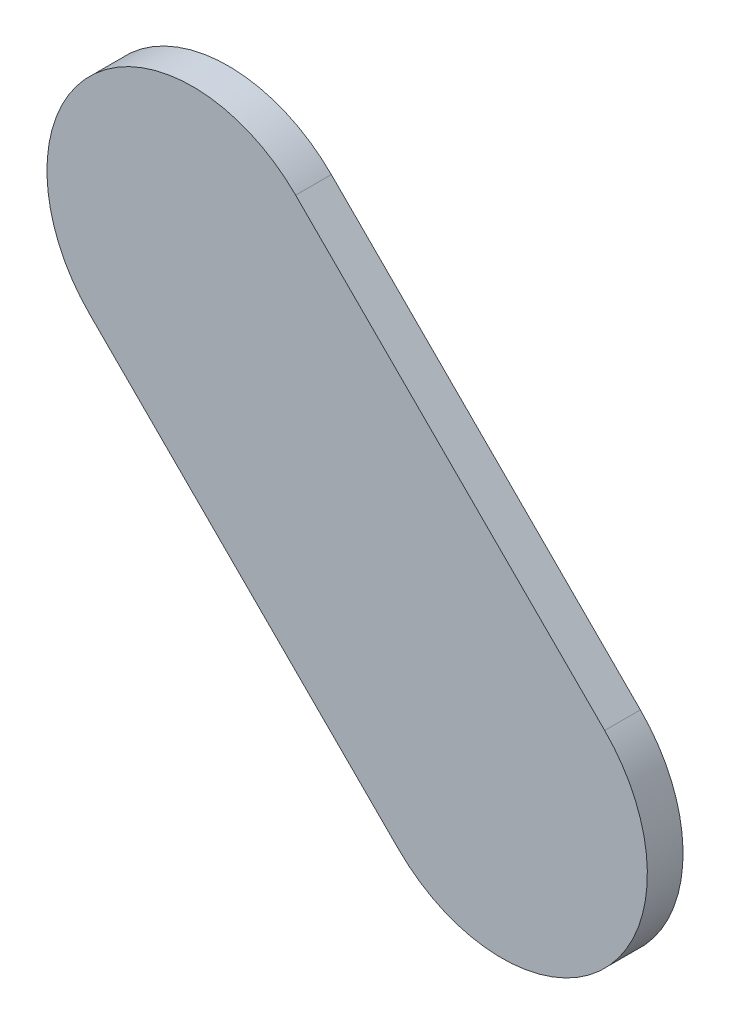
ISO-10303-21;
HEADER;
FILE_DESCRIPTION(('STEP AP214'),'2;1');
FILE_NAME('part.step','',(''),(''),'','','');
FILE_SCHEMA(('AUTOMOTIVE_DESIGN { 1 0 10303 214 1 1 1 1 }'));
ENDSEC;
DATA;
#1=APPLICATION_CONTEXT('core data for automotive mechanical design processes');
#2=APPLICATION_PROTOCOL_DEFINITION('international standard','automotive_design',2000,#1);
#3=PRODUCT_CONTEXT('',#1,'mechanical');
#4=PRODUCT('Part','Part','',(#3));
#5=PRODUCT_RELATED_PRODUCT_CATEGORY('part','',(#4));
#6=PRODUCT_DEFINITION_FORMATION('','',#4);
#7=PRODUCT_DEFINITION_CONTEXT('part definition',#1,'design');
#8=PRODUCT_DEFINITION('design','',#6,#7);
#9=PRODUCT_DEFINITION_SHAPE('','',#8);
#10=(LENGTH_UNIT() NAMED_UNIT(*) SI_UNIT(.MILLI.,.METRE.));
#11=(NAMED_UNIT(*) PLANE_ANGLE_UNIT() SI_UNIT($,.RADIAN.));
#12=(NAMED_UNIT(*) SI_UNIT($,.STERADIAN.) SOLID_ANGLE_UNIT());
#13=UNCERTAINTY_MEASURE_WITH_UNIT(LENGTH_MEASURE(1.E-05),#10,'distance_accuracy_value','');
#14=(GEOMETRIC_REPRESENTATION_CONTEXT(3) GLOBAL_UNCERTAINTY_ASSIGNED_CONTEXT((#13)) GLOBAL_UNIT_ASSIGNED_CONTEXT((#10,
#11,#12)) REPRESENTATION_CONTEXT('',''));
#15=CARTESIAN_POINT('',(0.,0.,0.));
#16=DIRECTION('',(0.,0.,1.));
#17=DIRECTION('',(1.,0.,0.));
#18=AXIS2_PLACEMENT_3D('',#15,#16,#17);
#19=CARTESIAN_POINT('',(7.190751666303,3.506661372288,0.76487));
#20=DIRECTION('',(0.,0.,-1.));
#21=DIRECTION('',(-1.,0.,0.));
#22=AXIS2_PLACEMENT_3D('',#19,#20,#21);
#23=PLANE('',#22);
#24=DIRECTION('',(0.707105987136602,-0.707107575235602,0.));
#25=VECTOR('',#24,1.);
#26=CARTESIAN_POINT('',(7.141361000001,3.753523,0.76487));
#27=LINE('',#26,#25);
#28=CARTESIAN_POINT('',(7.14136103026748,3.75352296973368,0.76487));
#29=VERTEX_POINT('',#28);
#30=CARTESIAN_POINT('',(7.43834555533316,3.45653777766617,0.76487));
#31=VERTEX_POINT('',#30);
#32=EDGE_CURVE('E54',#29,#31,#27,.T.);
#33=ORIENTED_EDGE('',*,*,#32,.T.);
#34=CARTESIAN_POINT('',(7.339350667,3.357542667,0.76487));
#35=DIRECTION('',(0.,0.,1.));
#36=DIRECTION('',(1.,0.,0.));
#37=AXIS2_PLACEMENT_3D('',#34,#35,#36);
#38=CIRCLE('',#37,0.140000070901);
#39=CARTESIAN_POINT('',(7.24035574790159,3.25854825310059,0.76487));
#40=VERTEX_POINT('',#39);
#41=EDGE_CURVE('E20',#40,#31,#38,.T.);
#42=ORIENTED_EDGE('',*,*,#41,.F.);
#43=DIRECTION('',(-0.707107575236102,0.707105987136102,0.));
#44=VECTOR('',#43,1.);
#45=CARTESIAN_POINT('',(7.240355667001,3.258548334001,0.76487));
#46=LINE('',#45,#44);
#47=CARTESIAN_POINT('',(6.94337055583361,3.55553277816655,0.76487));
#48=VERTEX_POINT('',#47);
#49=EDGE_CURVE('E78',#40,#48,#46,.T.);
#50=ORIENTED_EDGE('',*,*,#49,.T.);
#51=CARTESIAN_POINT('',(7.042365333,3.654528,0.76487));
#52=DIRECTION('',(0.,0.,1.));
#53=DIRECTION('',(1.,0.,0.));
#54=AXIS2_PLACEMENT_3D('',#51,#52,#53);
#55=CIRCLE('',#54,0.140000070901);
#56=EDGE_CURVE('E58',#29,#48,#55,.T.);
#57=ORIENTED_EDGE('',*,*,#56,.F.);
#58=EDGE_LOOP('',(#33,#42,#50,#57));
#59=FACE_BOUND('',#58,.T.);
#60=ADVANCED_FACE('F17',(#59),#23,.T.);
#61=CARTESIAN_POINT('',(7.339350667,3.357542667,0.76487));
#62=DIRECTION('',(0.,0.,1.));
#63=DIRECTION('',(1.,0.,0.));
#64=AXIS2_PLACEMENT_3D('',#61,#62,#63);
#65=CYLINDRICAL_SURFACE('',#64,0.140000070901);
#66=ORIENTED_EDGE('',*,*,#41,.T.);
#67=DIRECTION('',(0.,0.,1.));
#68=VECTOR('',#67,1.);
#69=CARTESIAN_POINT('',(7.43834533299991,3.45653799999991,0.76487));
#70=LINE('',#69,#68);
#71=CARTESIAN_POINT('',(7.43834555533321,3.45653777766625,0.79916));
#72=VERTEX_POINT('',#71);
#73=EDGE_CURVE('E62',#31,#72,#70,.T.);
#74=ORIENTED_EDGE('',*,*,#73,.T.);
#75=CARTESIAN_POINT('',(7.339350667001,3.357543232733,0.79916));
#76=DIRECTION('',(0.,0.,1.));
#77=DIRECTION('',(1.,0.,0.));
#78=AXIS2_PLACEMENT_3D('',#75,#76,#77);
#79=CIRCLE('',#78,0.14);
#80=CARTESIAN_POINT('',(7.24035574790163,3.25854825310056,0.79916));
#81=VERTEX_POINT('',#80);
#82=EDGE_CURVE('E82',#81,#72,#79,.T.);
#83=ORIENTED_EDGE('',*,*,#82,.F.);
#84=DIRECTION('',(0.,0.,1.));
#85=VECTOR('',#84,1.);
#86=CARTESIAN_POINT('',(7.240355667001,3.258548334001,0.76487));
#87=LINE('',#86,#85);
#88=EDGE_CURVE('E69',#81,#40,#87,.F.);
#89=ORIENTED_EDGE('',*,*,#88,.T.);
#90=EDGE_LOOP('',(#66,#74,#83,#89));
#91=FACE_BOUND('',#90,.T.);
#92=ADVANCED_FACE('F66',(#91),#65,.T.);
#93=CARTESIAN_POINT('',(7.141361000001,3.753523,0.76487));
#94=DIRECTION('',(-0.707107575235602,-0.707105987136602,0.));
#95=DIRECTION('',(0.707105987136602,-0.707107575235602,0.));
#96=AXIS2_PLACEMENT_3D('',#93,#94,#95);
#97=PLANE('',#96);
#98=ORIENTED_EDGE('',*,*,#73,.F.);
#99=ORIENTED_EDGE('',*,*,#32,.F.);
#100=DIRECTION('',(0.,0.,1.));
#101=VECTOR('',#100,1.);
#102=CARTESIAN_POINT('',(7.14136100000123,3.75352300000023,0.76487));
#103=LINE('',#102,#101);
#104=CARTESIAN_POINT('',(7.14136103026747,3.75352296973369,0.79916));
#105=VERTEX_POINT('',#104);
#106=EDGE_CURVE('E73',#105,#29,#103,.F.);
#107=ORIENTED_EDGE('',*,*,#106,.F.);
#108=DIRECTION('',(-0.707105987136807,0.707107575235396,0.));
#109=VECTOR('',#108,1.);
#110=CARTESIAN_POINT('',(7.438345333,3.456538,0.79916));
#111=LINE('',#110,#109);
#112=EDGE_CURVE('E72',#72,#105,#111,.T.);
#113=ORIENTED_EDGE('',*,*,#112,.F.);
#114=EDGE_LOOP('',(#98,#99,#107,#113));
#115=FACE_BOUND('',#114,.T.);
#116=ADVANCED_FACE('F71',(#115),#97,.F.);
#117=CARTESIAN_POINT('',(7.042365333,3.654528,0.76487));
#118=DIRECTION('',(0.,0.,1.));
#119=DIRECTION('',(1.,0.,0.));
#120=AXIS2_PLACEMENT_3D('',#117,#118,#119);
#121=CYLINDRICAL_SURFACE('',#120,0.140000070901);
#122=ORIENTED_EDGE('',*,*,#56,.T.);
#123=DIRECTION('',(0.,0.,1.));
#124=VECTOR('',#123,1.);
#125=CARTESIAN_POINT('',(6.9433706670002,3.5555326670002,0.76487));
#126=LINE('',#125,#124);
#127=CARTESIAN_POINT('',(6.94337055583354,3.55553277816642,0.79916));
#128=VERTEX_POINT('',#127);
#129=EDGE_CURVE('E79',#48,#128,#126,.T.);
#130=ORIENTED_EDGE('',*,*,#129,.T.);
#131=CARTESIAN_POINT('',(7.042365667,3.654527768268,0.79916));
#132=DIRECTION('',(0.,0.,1.));
#133=DIRECTION('',(1.,0.,0.));
#134=AXIS2_PLACEMENT_3D('',#131,#132,#133);
#135=CIRCLE('',#134,0.140000470934);
#136=EDGE_CURVE('E26',#105,#128,#135,.T.);
#137=ORIENTED_EDGE('',*,*,#136,.F.);
#138=ORIENTED_EDGE('',*,*,#106,.T.);
#139=EDGE_LOOP('',(#122,#130,#137,#138));
#140=FACE_BOUND('',#139,.T.);
#141=ADVANCED_FACE('F91',(#140),#121,.T.);
#142=CARTESIAN_POINT('',(7.240355667001,3.258548334001,0.76487));
#143=DIRECTION('',(0.707105987136102,0.707107575236102,0.));
#144=DIRECTION('',(-0.707107575236102,0.707105987136102,0.));
#145=AXIS2_PLACEMENT_3D('',#142,#143,#144);
#146=PLANE('',#145);
#147=ORIENTED_EDGE('',*,*,#129,.F.);
#148=ORIENTED_EDGE('',*,*,#49,.F.);
#149=ORIENTED_EDGE('',*,*,#88,.F.);
#150=DIRECTION('',(0.707107575236588,-0.707105987135616,0.));
#151=VECTOR('',#150,1.);
#152=CARTESIAN_POINT('',(6.943370667,3.555532667,0.79916));
#153=LINE('',#152,#151);
#154=EDGE_CURVE('E11',#128,#81,#153,.T.);
#155=ORIENTED_EDGE('',*,*,#154,.F.);
#156=EDGE_LOOP('',(#147,#148,#149,#155));
#157=FACE_BOUND('',#156,.T.);
#158=ADVANCED_FACE('F90',(#157),#146,.F.);
#159=CARTESIAN_POINT('',(7.190751666303,3.506661372288,0.79916));
#160=DIRECTION('',(0.,0.,1.));
#161=DIRECTION('',(1.,0.,0.));
#162=AXIS2_PLACEMENT_3D('',#159,#160,#161);
#163=PLANE('',#162);
#164=ORIENTED_EDGE('',*,*,#136,.T.);
#165=ORIENTED_EDGE('',*,*,#154,.T.);
#166=ORIENTED_EDGE('',*,*,#82,.T.);
#167=ORIENTED_EDGE('',*,*,#112,.T.);
#168=EDGE_LOOP('',(#164,#165,#166,#167));
#169=FACE_BOUND('',#168,.T.);
#170=ADVANCED_FACE('F87',(#169),#163,.T.);
#171=CLOSED_SHELL('',(#60,#92,#116,#141,#158,#170));
#172=MANIFOLD_SOLID_BREP('B1',#171);
#173=ADVANCED_BREP_SHAPE_REPRESENTATION('',(#18,#172),#14);
#174=SHAPE_DEFINITION_REPRESENTATION(#9,#173);
ENDSEC;
END-ISO-10303-21;
